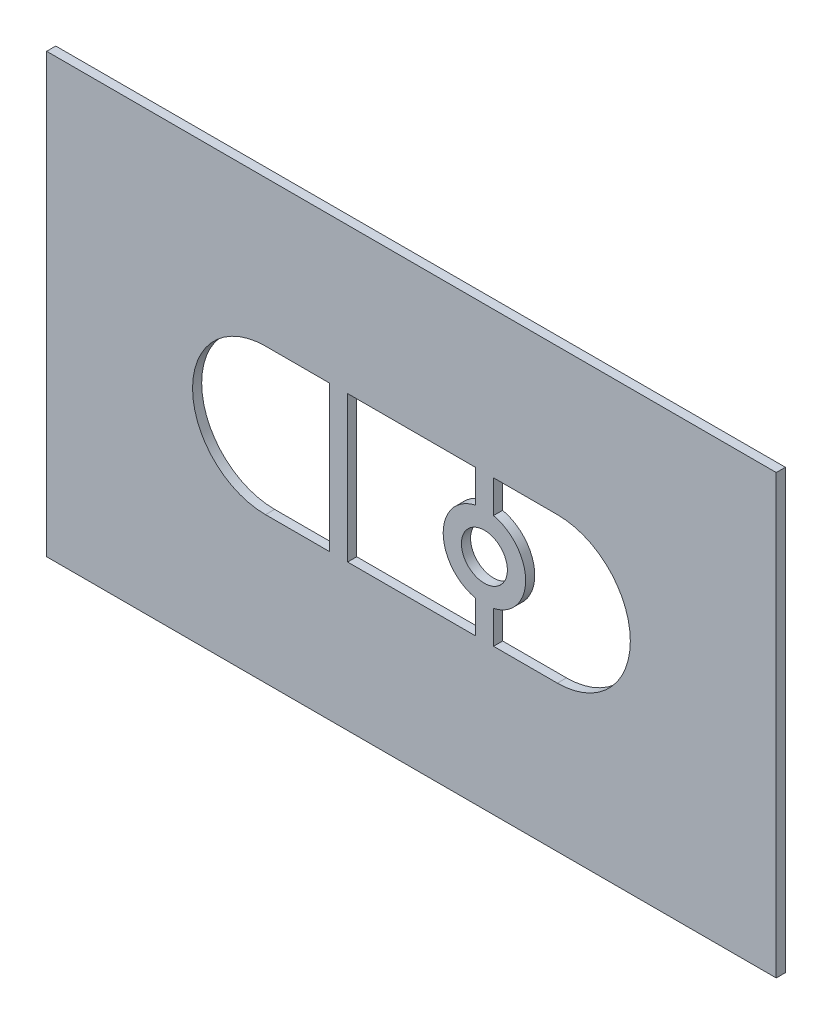
ISO-10303-21;
HEADER;
FILE_DESCRIPTION(('STEP AP214'),'2;1');
FILE_NAME('part.step','',(''),(''),'','','');
FILE_SCHEMA(('AUTOMOTIVE_DESIGN { 1 0 10303 214 1 1 1 1 }'));
ENDSEC;
DATA;
#1=APPLICATION_CONTEXT('core data for automotive mechanical design processes');
#2=APPLICATION_PROTOCOL_DEFINITION('international standard','automotive_design',2000,#1);
#3=PRODUCT_CONTEXT('',#1,'mechanical');
#4=PRODUCT('Part','Part','',(#3));
#5=PRODUCT_RELATED_PRODUCT_CATEGORY('part','',(#4));
#6=PRODUCT_DEFINITION_FORMATION('','',#4);
#7=PRODUCT_DEFINITION_CONTEXT('part definition',#1,'design');
#8=PRODUCT_DEFINITION('design','',#6,#7);
#9=PRODUCT_DEFINITION_SHAPE('','',#8);
#10=(LENGTH_UNIT() NAMED_UNIT(*) SI_UNIT(.MILLI.,.METRE.));
#11=(NAMED_UNIT(*) PLANE_ANGLE_UNIT() SI_UNIT($,.RADIAN.));
#12=(NAMED_UNIT(*) SI_UNIT($,.STERADIAN.) SOLID_ANGLE_UNIT());
#13=UNCERTAINTY_MEASURE_WITH_UNIT(LENGTH_MEASURE(1.E-05),#10,'distance_accuracy_value','');
#14=(GEOMETRIC_REPRESENTATION_CONTEXT(3) GLOBAL_UNCERTAINTY_ASSIGNED_CONTEXT((#13)) GLOBAL_UNIT_ASSIGNED_CONTEXT((#10,
#11,#12)) REPRESENTATION_CONTEXT('',''));
#15=CARTESIAN_POINT('',(0.,0.,0.));
#16=DIRECTION('',(0.,0.,1.));
#17=DIRECTION('',(1.,0.,0.));
#18=AXIS2_PLACEMENT_3D('',#15,#16,#17);
#19=CARTESIAN_POINT('',(0.,0.,1.5875));
#20=DIRECTION('',(0.,0.,-1.));
#21=DIRECTION('',(-1.,0.,0.));
#22=AXIS2_PLACEMENT_3D('',#19,#20,#21);
#23=PLANE('',#22);
#24=CARTESIAN_POINT('',(88.9,38.1,1.5875));
#25=DIRECTION('',(0.,0.,1.));
#26=DIRECTION('',(1.,0.,0.));
#27=AXIS2_PLACEMENT_3D('',#24,#25,#26);
#28=CIRCLE('',#27,12.7);
#29=CARTESIAN_POINT('',(88.9,25.4,1.5875));
#30=VERTEX_POINT('',#29);
#31=CARTESIAN_POINT('',(88.9,50.8,1.5875));
#32=VERTEX_POINT('',#31);
#33=EDGE_CURVE('E249',#30,#32,#28,.T.);
#34=ORIENTED_EDGE('',*,*,#33,.F.);
#35=DIRECTION('',(1.,0.,0.));
#36=VECTOR('',#35,1.);
#37=CARTESIAN_POINT('',(88.9,25.4,1.5875));
#38=LINE('',#37,#36);
#39=CARTESIAN_POINT('',(77.7875,25.4,1.5875));
#40=VERTEX_POINT('',#39);
#41=EDGE_CURVE('E266',#40,#30,#38,.T.);
#42=ORIENTED_EDGE('',*,*,#41,.F.);
#43=DIRECTION('',(0.,-1.,0.));
#44=VECTOR('',#43,1.);
#45=CARTESIAN_POINT('',(77.7875,31.1028242304484,1.5875));
#46=LINE('',#45,#44);
#47=CARTESIAN_POINT('',(77.7875,31.1028242304484,1.5875));
#48=VERTEX_POINT('',#47);
#49=EDGE_CURVE('E262',#48,#40,#46,.T.);
#50=ORIENTED_EDGE('',*,*,#49,.F.);
#51=CARTESIAN_POINT('',(76.2,38.1,1.5875));
#52=DIRECTION('',(0.,0.,-1.));
#53=DIRECTION('',(1.,0.,0.));
#54=AXIS2_PLACEMENT_3D('',#51,#52,#53);
#55=CIRCLE('',#54,7.17499999999999);
#56=CARTESIAN_POINT('',(77.7875,45.0971757695516,1.5875));
#57=VERTEX_POINT('',#56);
#58=EDGE_CURVE('E259',#57,#48,#55,.T.);
#59=ORIENTED_EDGE('',*,*,#58,.F.);
#60=DIRECTION('',(0.,-1.,0.));
#61=VECTOR('',#60,1.);
#62=CARTESIAN_POINT('',(77.7875,50.8,1.5875));
#63=LINE('',#62,#61);
#64=CARTESIAN_POINT('',(77.7875,50.8,1.5875));
#65=VERTEX_POINT('',#64);
#66=EDGE_CURVE('E256',#65,#57,#63,.T.);
#67=ORIENTED_EDGE('',*,*,#66,.F.);
#68=DIRECTION('',(-1.,0.,0.));
#69=VECTOR('',#68,1.);
#70=CARTESIAN_POINT('',(77.7875,50.8,1.5875));
#71=LINE('',#70,#69);
#72=EDGE_CURVE('E252',#32,#65,#71,.T.);
#73=ORIENTED_EDGE('',*,*,#72,.F.);
#74=EDGE_LOOP('',(#34,#42,#50,#59,#67,#73));
#75=FACE_BOUND('',#74,.T.);
#76=DIRECTION('',(0.,-1.,0.));
#77=VECTOR('',#76,1.);
#78=CARTESIAN_POINT('',(0.,0.,1.5875));
#79=LINE('',#78,#77);
#80=CARTESIAN_POINT('',(0.,76.2,1.5875));
#81=VERTEX_POINT('',#80);
#82=CARTESIAN_POINT('',(0.,0.,1.5875));
#83=VERTEX_POINT('',#82);
#84=EDGE_CURVE('E355',#81,#83,#79,.T.);
#85=ORIENTED_EDGE('',*,*,#84,.T.);
#86=DIRECTION('',(1.,0.,0.));
#87=VECTOR('',#86,1.);
#88=CARTESIAN_POINT('',(0.,0.,1.5875));
#89=LINE('',#88,#87);
#90=CARTESIAN_POINT('',(127.,0.,1.5875));
#91=VERTEX_POINT('',#90);
#92=EDGE_CURVE('E359',#83,#91,#89,.T.);
#93=ORIENTED_EDGE('',*,*,#92,.T.);
#94=DIRECTION('',(0.,1.,0.));
#95=VECTOR('',#94,1.);
#96=CARTESIAN_POINT('',(127.,0.,1.5875));
#97=LINE('',#96,#95);
#98=CARTESIAN_POINT('',(127.,76.2,1.5875));
#99=VERTEX_POINT('',#98);
#100=EDGE_CURVE('E363',#91,#99,#97,.T.);
#101=ORIENTED_EDGE('',*,*,#100,.T.);
#102=DIRECTION('',(-1.,0.,0.));
#103=VECTOR('',#102,1.);
#104=CARTESIAN_POINT('',(0.,76.2,1.5875));
#105=LINE('',#104,#103);
#106=EDGE_CURVE('E366',#99,#81,#105,.T.);
#107=ORIENTED_EDGE('',*,*,#106,.T.);
#108=EDGE_LOOP('',(#85,#93,#101,#107));
#109=FACE_BOUND('',#108,.T.);
#110=DIRECTION('',(0.,1.,0.));
#111=VECTOR('',#110,1.);
#112=CARTESIAN_POINT('',(49.2125,50.8,1.5875));
#113=LINE('',#112,#111);
#114=CARTESIAN_POINT('',(49.2125,25.4,1.5875));
#115=VERTEX_POINT('',#114);
#116=CARTESIAN_POINT('',(49.2125,50.8,1.5875));
#117=VERTEX_POINT('',#116);
#118=EDGE_CURVE('E312',#115,#117,#113,.T.);
#119=ORIENTED_EDGE('',*,*,#118,.F.);
#120=DIRECTION('',(1.,0.,0.));
#121=VECTOR('',#120,1.);
#122=CARTESIAN_POINT('',(49.2125,25.4,1.5875));
#123=LINE('',#122,#121);
#124=CARTESIAN_POINT('',(38.1,25.4,1.5875));
#125=VERTEX_POINT('',#124);
#126=EDGE_CURVE('E323',#125,#115,#123,.T.);
#127=ORIENTED_EDGE('',*,*,#126,.F.);
#128=CARTESIAN_POINT('',(38.1,38.1,1.5875));
#129=DIRECTION('',(0.,0.,1.));
#130=DIRECTION('',(1.,0.,0.));
#131=AXIS2_PLACEMENT_3D('',#128,#129,#130);
#132=CIRCLE('',#131,12.7);
#133=CARTESIAN_POINT('',(38.1,50.8,1.5875));
#134=VERTEX_POINT('',#133);
#135=EDGE_CURVE('E319',#134,#125,#132,.T.);
#136=ORIENTED_EDGE('',*,*,#135,.F.);
#137=DIRECTION('',(-1.,0.,0.));
#138=VECTOR('',#137,1.);
#139=CARTESIAN_POINT('',(38.1,50.8,1.5875));
#140=LINE('',#139,#138);
#141=EDGE_CURVE('E315',#117,#134,#140,.T.);
#142=ORIENTED_EDGE('',*,*,#141,.F.);
#143=EDGE_LOOP('',(#119,#127,#136,#142));
#144=FACE_BOUND('',#143,.T.);
#145=DIRECTION('',(0.,1.,0.));
#146=VECTOR('',#145,1.);
#147=CARTESIAN_POINT('',(74.6125,50.8,1.5875));
#148=LINE('',#147,#146);
#149=CARTESIAN_POINT('',(74.6125,45.0971757695516,1.5875));
#150=VERTEX_POINT('',#149);
#151=CARTESIAN_POINT('',(74.6125,50.8,1.5875));
#152=VERTEX_POINT('',#151);
#153=EDGE_CURVE('E177',#150,#152,#148,.T.);
#154=ORIENTED_EDGE('',*,*,#153,.F.);
#155=CARTESIAN_POINT('',(76.2,38.1,1.5875));
#156=DIRECTION('',(0.,0.,-1.));
#157=DIRECTION('',(1.,0.,0.));
#158=AXIS2_PLACEMENT_3D('',#155,#156,#157);
#159=CIRCLE('',#158,7.175);
#160=CARTESIAN_POINT('',(74.6125,31.1028242304484,1.5875));
#161=VERTEX_POINT('',#160);
#162=EDGE_CURVE('E214',#161,#150,#159,.T.);
#163=ORIENTED_EDGE('',*,*,#162,.F.);
#164=DIRECTION('',(0.,1.,0.));
#165=VECTOR('',#164,1.);
#166=CARTESIAN_POINT('',(74.6125,31.1028242304484,1.5875));
#167=LINE('',#166,#165);
#168=CARTESIAN_POINT('',(74.6125,25.4,1.5875));
#169=VERTEX_POINT('',#168);
#170=EDGE_CURVE('E211',#169,#161,#167,.T.);
#171=ORIENTED_EDGE('',*,*,#170,.F.);
#172=DIRECTION('',(1.,0.,0.));
#173=VECTOR('',#172,1.);
#174=CARTESIAN_POINT('',(74.6125,25.4,1.5875));
#175=LINE('',#174,#173);
#176=CARTESIAN_POINT('',(52.3875,25.4,1.5875));
#177=VERTEX_POINT('',#176);
#178=EDGE_CURVE('E205',#177,#169,#175,.T.);
#179=ORIENTED_EDGE('',*,*,#178,.F.);
#180=DIRECTION('',(0.,-1.,0.));
#181=VECTOR('',#180,1.);
#182=CARTESIAN_POINT('',(52.3875,25.4,1.5875));
#183=LINE('',#182,#181);
#184=CARTESIAN_POINT('',(52.3875,50.8,1.5875));
#185=VERTEX_POINT('',#184);
#186=EDGE_CURVE('E201',#185,#177,#183,.T.);
#187=ORIENTED_EDGE('',*,*,#186,.F.);
#188=DIRECTION('',(-1.,0.,0.));
#189=VECTOR('',#188,1.);
#190=CARTESIAN_POINT('',(52.3875,50.8,1.5875));
#191=LINE('',#190,#189);
#192=EDGE_CURVE('E186',#152,#185,#191,.T.);
#193=ORIENTED_EDGE('',*,*,#192,.F.);
#194=EDGE_LOOP('',(#154,#163,#171,#179,#187,#193));
#195=FACE_BOUND('',#194,.T.);
#196=CARTESIAN_POINT('',(76.2,38.1,1.5875));
#197=DIRECTION('',(0.,0.,1.));
#198=DIRECTION('',(1.,0.,0.));
#199=AXIS2_PLACEMENT_3D('',#196,#197,#198);
#200=CIRCLE('',#199,3.99999999999999);
#201=CARTESIAN_POINT('',(80.2,38.1,1.5875));
#202=VERTEX_POINT('',#201);
#203=EDGE_CURVE('E219',#202,#202,#200,.T.);
#204=ORIENTED_EDGE('',*,*,#203,.F.);
#205=EDGE_LOOP('',(#204));
#206=FACE_BOUND('',#205,.T.);
#207=ADVANCED_FACE('F39',(#75,#109,#144,#195,#206),#23,.F.);
#208=CARTESIAN_POINT('',(0.,0.,0.));
#209=DIRECTION('',(0.,0.,-1.));
#210=DIRECTION('',(-1.,0.,0.));
#211=AXIS2_PLACEMENT_3D('',#208,#209,#210);
#212=PLANE('',#211);
#213=CARTESIAN_POINT('',(76.2,38.1,0.));
#214=DIRECTION('',(0.,0.,-1.));
#215=DIRECTION('',(1.,0.,0.));
#216=AXIS2_PLACEMENT_3D('',#213,#214,#215);
#217=CIRCLE('',#216,7.175);
#218=CARTESIAN_POINT('',(74.6125,31.1028242304484,0.));
#219=VERTEX_POINT('',#218);
#220=CARTESIAN_POINT('',(74.6125,45.0971757695516,0.));
#221=VERTEX_POINT('',#220);
#222=EDGE_CURVE('E187',#219,#221,#217,.T.);
#223=ORIENTED_EDGE('',*,*,#222,.T.);
#224=DIRECTION('',(0.,1.,0.));
#225=VECTOR('',#224,1.);
#226=CARTESIAN_POINT('',(74.6125,50.8,0.));
#227=LINE('',#226,#225);
#228=CARTESIAN_POINT('',(74.6125,50.8,0.));
#229=VERTEX_POINT('',#228);
#230=EDGE_CURVE('E63',#221,#229,#227,.T.);
#231=ORIENTED_EDGE('',*,*,#230,.T.);
#232=DIRECTION('',(-1.,0.,0.));
#233=VECTOR('',#232,1.);
#234=CARTESIAN_POINT('',(52.3875,50.8,0.));
#235=LINE('',#234,#233);
#236=CARTESIAN_POINT('',(52.3875,50.8,0.));
#237=VERTEX_POINT('',#236);
#238=EDGE_CURVE('E193',#229,#237,#235,.T.);
#239=ORIENTED_EDGE('',*,*,#238,.T.);
#240=DIRECTION('',(0.,-1.,0.));
#241=VECTOR('',#240,1.);
#242=CARTESIAN_POINT('',(52.3875,25.4,0.));
#243=LINE('',#242,#241);
#244=CARTESIAN_POINT('',(52.3875,25.4,0.));
#245=VERTEX_POINT('',#244);
#246=EDGE_CURVE('E222',#237,#245,#243,.T.);
#247=ORIENTED_EDGE('',*,*,#246,.T.);
#248=DIRECTION('',(1.,0.,0.));
#249=VECTOR('',#248,1.);
#250=CARTESIAN_POINT('',(74.6125,25.4,0.));
#251=LINE('',#250,#249);
#252=CARTESIAN_POINT('',(74.6125,25.4,0.));
#253=VERTEX_POINT('',#252);
#254=EDGE_CURVE('E226',#245,#253,#251,.T.);
#255=ORIENTED_EDGE('',*,*,#254,.T.);
#256=DIRECTION('',(0.,1.,0.));
#257=VECTOR('',#256,1.);
#258=CARTESIAN_POINT('',(74.6125,31.1028242304484,0.));
#259=LINE('',#258,#257);
#260=EDGE_CURVE('E230',#253,#219,#259,.T.);
#261=ORIENTED_EDGE('',*,*,#260,.T.);
#262=EDGE_LOOP('',(#223,#231,#239,#247,#255,#261));
#263=FACE_BOUND('',#262,.T.);
#264=DIRECTION('',(1.,0.,0.));
#265=VECTOR('',#264,1.);
#266=CARTESIAN_POINT('',(88.9,25.4,0.));
#267=LINE('',#266,#265);
#268=CARTESIAN_POINT('',(77.7875,25.4,0.));
#269=VERTEX_POINT('',#268);
#270=CARTESIAN_POINT('',(88.9,25.4,0.));
#271=VERTEX_POINT('',#270);
#272=EDGE_CURVE('E253',#269,#271,#267,.T.);
#273=ORIENTED_EDGE('',*,*,#272,.T.);
#274=CARTESIAN_POINT('',(88.9,38.1,0.));
#275=DIRECTION('',(0.,0.,1.));
#276=DIRECTION('',(1.,0.,0.));
#277=AXIS2_PLACEMENT_3D('',#274,#275,#276);
#278=CIRCLE('',#277,12.7);
#279=CARTESIAN_POINT('',(88.9,50.8,0.));
#280=VERTEX_POINT('',#279);
#281=EDGE_CURVE('E195',#271,#280,#278,.T.);
#282=ORIENTED_EDGE('',*,*,#281,.T.);
#283=DIRECTION('',(-1.,0.,0.));
#284=VECTOR('',#283,1.);
#285=CARTESIAN_POINT('',(77.7875,50.8,0.));
#286=LINE('',#285,#284);
#287=CARTESIAN_POINT('',(77.7875,50.8,0.));
#288=VERTEX_POINT('',#287);
#289=EDGE_CURVE('E273',#280,#288,#286,.T.);
#290=ORIENTED_EDGE('',*,*,#289,.T.);
#291=DIRECTION('',(0.,-1.,0.));
#292=VECTOR('',#291,1.);
#293=CARTESIAN_POINT('',(77.7875,50.8,0.));
#294=LINE('',#293,#292);
#295=CARTESIAN_POINT('',(77.7875,45.0971757695516,0.));
#296=VERTEX_POINT('',#295);
#297=EDGE_CURVE('E277',#288,#296,#294,.T.);
#298=ORIENTED_EDGE('',*,*,#297,.T.);
#299=CARTESIAN_POINT('',(76.2,38.1,0.));
#300=DIRECTION('',(0.,0.,-1.));
#301=DIRECTION('',(1.,0.,0.));
#302=AXIS2_PLACEMENT_3D('',#299,#300,#301);
#303=CIRCLE('',#302,7.17499999999999);
#304=CARTESIAN_POINT('',(77.7875,31.1028242304484,0.));
#305=VERTEX_POINT('',#304);
#306=EDGE_CURVE('E281',#296,#305,#303,.T.);
#307=ORIENTED_EDGE('',*,*,#306,.T.);
#308=DIRECTION('',(0.,-1.,0.));
#309=VECTOR('',#308,1.);
#310=CARTESIAN_POINT('',(77.7875,31.1028242304484,0.));
#311=LINE('',#310,#309);
#312=EDGE_CURVE('E285',#305,#269,#311,.T.);
#313=ORIENTED_EDGE('',*,*,#312,.T.);
#314=EDGE_LOOP('',(#273,#282,#290,#298,#307,#313));
#315=FACE_BOUND('',#314,.T.);
#316=DIRECTION('',(1.,0.,0.));
#317=VECTOR('',#316,1.);
#318=CARTESIAN_POINT('',(49.2125,25.4,0.));
#319=LINE('',#318,#317);
#320=CARTESIAN_POINT('',(38.1,25.4,0.));
#321=VERTEX_POINT('',#320);
#322=CARTESIAN_POINT('',(49.2125,25.4,0.));
#323=VERTEX_POINT('',#322);
#324=EDGE_CURVE('E316',#321,#323,#319,.T.);
#325=ORIENTED_EDGE('',*,*,#324,.T.);
#326=DIRECTION('',(0.,1.,0.));
#327=VECTOR('',#326,1.);
#328=CARTESIAN_POINT('',(49.2125,50.8,0.));
#329=LINE('',#328,#327);
#330=CARTESIAN_POINT('',(49.2125,50.8,0.));
#331=VERTEX_POINT('',#330);
#332=EDGE_CURVE('E311',#323,#331,#329,.T.);
#333=ORIENTED_EDGE('',*,*,#332,.T.);
#334=DIRECTION('',(-1.,0.,0.));
#335=VECTOR('',#334,1.);
#336=CARTESIAN_POINT('',(38.1,50.8,0.));
#337=LINE('',#336,#335);
#338=CARTESIAN_POINT('',(38.1,50.8,0.));
#339=VERTEX_POINT('',#338);
#340=EDGE_CURVE('E330',#331,#339,#337,.T.);
#341=ORIENTED_EDGE('',*,*,#340,.T.);
#342=CARTESIAN_POINT('',(38.1,38.1,0.));
#343=DIRECTION('',(0.,0.,1.));
#344=DIRECTION('',(1.,0.,0.));
#345=AXIS2_PLACEMENT_3D('',#342,#343,#344);
#346=CIRCLE('',#345,12.7);
#347=EDGE_CURVE('E334',#339,#321,#346,.T.);
#348=ORIENTED_EDGE('',*,*,#347,.T.);
#349=EDGE_LOOP('',(#325,#333,#341,#348));
#350=FACE_BOUND('',#349,.T.);
#351=DIRECTION('',(0.,-1.,0.));
#352=VECTOR('',#351,1.);
#353=CARTESIAN_POINT('',(0.,0.,0.));
#354=LINE('',#353,#352);
#355=CARTESIAN_POINT('',(0.,76.2,0.));
#356=VERTEX_POINT('',#355);
#357=CARTESIAN_POINT('',(0.,0.,0.));
#358=VERTEX_POINT('',#357);
#359=EDGE_CURVE('E354',#356,#358,#354,.T.);
#360=ORIENTED_EDGE('',*,*,#359,.F.);
#361=DIRECTION('',(-1.,0.,0.));
#362=VECTOR('',#361,1.);
#363=CARTESIAN_POINT('',(0.,76.2,0.));
#364=LINE('',#363,#362);
#365=CARTESIAN_POINT('',(127.,76.2,0.));
#366=VERTEX_POINT('',#365);
#367=EDGE_CURVE('E360',#366,#356,#364,.T.);
#368=ORIENTED_EDGE('',*,*,#367,.F.);
#369=DIRECTION('',(0.,1.,0.));
#370=VECTOR('',#369,1.);
#371=CARTESIAN_POINT('',(127.,0.,0.));
#372=LINE('',#371,#370);
#373=CARTESIAN_POINT('',(127.,0.,0.));
#374=VERTEX_POINT('',#373);
#375=EDGE_CURVE('E376',#374,#366,#372,.T.);
#376=ORIENTED_EDGE('',*,*,#375,.F.);
#377=DIRECTION('',(1.,0.,0.));
#378=VECTOR('',#377,1.);
#379=CARTESIAN_POINT('',(0.,0.,0.));
#380=LINE('',#379,#378);
#381=EDGE_CURVE('E373',#358,#374,#380,.T.);
#382=ORIENTED_EDGE('',*,*,#381,.F.);
#383=EDGE_LOOP('',(#360,#368,#376,#382));
#384=FACE_BOUND('',#383,.T.);
#385=CARTESIAN_POINT('',(76.2,38.1,0.));
#386=DIRECTION('',(0.,0.,1.));
#387=DIRECTION('',(1.,0.,0.));
#388=AXIS2_PLACEMENT_3D('',#385,#386,#387);
#389=CIRCLE('',#388,3.99999999999999);
#390=CARTESIAN_POINT('',(80.2,38.1,0.));
#391=VERTEX_POINT('',#390);
#392=EDGE_CURVE('E514',#391,#391,#389,.T.);
#393=ORIENTED_EDGE('',*,*,#392,.T.);
#394=EDGE_LOOP('',(#393));
#395=FACE_BOUND('',#394,.T.);
#396=ADVANCED_FACE('F399',(#263,#315,#350,#384,#395),#212,.T.);
#397=CARTESIAN_POINT('',(0.,0.,1.5875));
#398=DIRECTION('',(1.,0.,0.));
#399=DIRECTION('',(0.,0.,-1.));
#400=AXIS2_PLACEMENT_3D('',#397,#398,#399);
#401=PLANE('',#400);
#402=ORIENTED_EDGE('',*,*,#359,.T.);
#403=DIRECTION('',(0.,0.,-1.));
#404=VECTOR('',#403,1.);
#405=CARTESIAN_POINT('',(0.,0.,1.5875));
#406=LINE('',#405,#404);
#407=EDGE_CURVE('E11',#83,#358,#406,.T.);
#408=ORIENTED_EDGE('',*,*,#407,.F.);
#409=ORIENTED_EDGE('',*,*,#84,.F.);
#410=DIRECTION('',(0.,0.,-1.));
#411=VECTOR('',#410,1.);
#412=CARTESIAN_POINT('',(0.,76.2,1.5875));
#413=LINE('',#412,#411);
#414=EDGE_CURVE('E369',#81,#356,#413,.T.);
#415=ORIENTED_EDGE('',*,*,#414,.T.);
#416=EDGE_LOOP('',(#402,#408,#409,#415));
#417=FACE_BOUND('',#416,.T.);
#418=ADVANCED_FACE('F41',(#417),#401,.F.);
#419=CARTESIAN_POINT('',(0.,0.,1.5875));
#420=DIRECTION('',(0.,1.,0.));
#421=DIRECTION('',(0.,0.,1.));
#422=AXIS2_PLACEMENT_3D('',#419,#420,#421);
#423=PLANE('',#422);
#424=ORIENTED_EDGE('',*,*,#381,.T.);
#425=DIRECTION('',(0.,0.,-1.));
#426=VECTOR('',#425,1.);
#427=CARTESIAN_POINT('',(127.,0.,1.5875));
#428=LINE('',#427,#426);
#429=EDGE_CURVE('E48',#91,#374,#428,.T.);
#430=ORIENTED_EDGE('',*,*,#429,.F.);
#431=ORIENTED_EDGE('',*,*,#92,.F.);
#432=ORIENTED_EDGE('',*,*,#407,.T.);
#433=EDGE_LOOP('',(#424,#430,#431,#432));
#434=FACE_BOUND('',#433,.T.);
#435=ADVANCED_FACE('F410',(#434),#423,.F.);
#436=CARTESIAN_POINT('',(127.,0.,1.5875));
#437=DIRECTION('',(-1.,0.,0.));
#438=DIRECTION('',(0.,0.,1.));
#439=AXIS2_PLACEMENT_3D('',#436,#437,#438);
#440=PLANE('',#439);
#441=ORIENTED_EDGE('',*,*,#375,.T.);
#442=DIRECTION('',(0.,0.,-1.));
#443=VECTOR('',#442,1.);
#444=CARTESIAN_POINT('',(127.,76.2,1.5875));
#445=LINE('',#444,#443);
#446=EDGE_CURVE('E384',#99,#366,#445,.T.);
#447=ORIENTED_EDGE('',*,*,#446,.F.);
#448=ORIENTED_EDGE('',*,*,#100,.F.);
#449=ORIENTED_EDGE('',*,*,#429,.T.);
#450=EDGE_LOOP('',(#441,#447,#448,#449));
#451=FACE_BOUND('',#450,.T.);
#452=ADVANCED_FACE('F393',(#451),#440,.F.);
#453=CARTESIAN_POINT('',(0.,76.2,1.5875));
#454=DIRECTION('',(0.,-1.,0.));
#455=DIRECTION('',(0.,0.,-1.));
#456=AXIS2_PLACEMENT_3D('',#453,#454,#455);
#457=PLANE('',#456);
#458=ORIENTED_EDGE('',*,*,#367,.T.);
#459=ORIENTED_EDGE('',*,*,#414,.F.);
#460=ORIENTED_EDGE('',*,*,#106,.F.);
#461=ORIENTED_EDGE('',*,*,#446,.T.);
#462=EDGE_LOOP('',(#458,#459,#460,#461));
#463=FACE_BOUND('',#462,.T.);
#464=ADVANCED_FACE('F403',(#463),#457,.F.);
#465=CARTESIAN_POINT('',(49.2125,50.8,1.5875));
#466=DIRECTION('',(-1.,0.,0.));
#467=DIRECTION('',(0.,0.,1.));
#468=AXIS2_PLACEMENT_3D('',#465,#466,#467);
#469=PLANE('',#468);
#470=ORIENTED_EDGE('',*,*,#332,.F.);
#471=DIRECTION('',(0.,0.,-1.));
#472=VECTOR('',#471,1.);
#473=CARTESIAN_POINT('',(49.2125,25.4,1.5875));
#474=LINE('',#473,#472);
#475=EDGE_CURVE('E326',#115,#323,#474,.T.);
#476=ORIENTED_EDGE('',*,*,#475,.F.);
#477=ORIENTED_EDGE('',*,*,#118,.T.);
#478=DIRECTION('',(0.,0.,-1.));
#479=VECTOR('',#478,1.);
#480=CARTESIAN_POINT('',(49.2125,50.8,1.5875));
#481=LINE('',#480,#479);
#482=EDGE_CURVE('E350',#117,#331,#481,.T.);
#483=ORIENTED_EDGE('',*,*,#482,.T.);
#484=EDGE_LOOP('',(#470,#476,#477,#483));
#485=FACE_BOUND('',#484,.T.);
#486=ADVANCED_FACE('F427',(#485),#469,.T.);
#487=CARTESIAN_POINT('',(38.1,50.8,1.5875));
#488=DIRECTION('',(0.,-1.,0.));
#489=DIRECTION('',(0.,0.,-1.));
#490=AXIS2_PLACEMENT_3D('',#487,#488,#489);
#491=PLANE('',#490);
#492=ORIENTED_EDGE('',*,*,#340,.F.);
#493=ORIENTED_EDGE('',*,*,#482,.F.);
#494=ORIENTED_EDGE('',*,*,#141,.T.);
#495=DIRECTION('',(0.,0.,-1.));
#496=VECTOR('',#495,1.);
#497=CARTESIAN_POINT('',(38.1,50.8,1.5875));
#498=LINE('',#497,#496);
#499=EDGE_CURVE('E347',#134,#339,#498,.T.);
#500=ORIENTED_EDGE('',*,*,#499,.T.);
#501=EDGE_LOOP('',(#492,#493,#494,#500));
#502=FACE_BOUND('',#501,.T.);
#503=ADVANCED_FACE('F434',(#502),#491,.T.);
#504=CARTESIAN_POINT('',(38.1,38.1,1.5875));
#505=DIRECTION('',(0.,0.,-1.));
#506=DIRECTION('',(-1.,0.,0.));
#507=AXIS2_PLACEMENT_3D('',#504,#505,#506);
#508=CYLINDRICAL_SURFACE('',#507,12.7);
#509=ORIENTED_EDGE('',*,*,#347,.F.);
#510=ORIENTED_EDGE('',*,*,#499,.F.);
#511=ORIENTED_EDGE('',*,*,#135,.T.);
#512=DIRECTION('',(0.,0.,-1.));
#513=VECTOR('',#512,1.);
#514=CARTESIAN_POINT('',(38.1,25.4,1.5875));
#515=LINE('',#514,#513);
#516=EDGE_CURVE('E344',#125,#321,#515,.T.);
#517=ORIENTED_EDGE('',*,*,#516,.T.);
#518=EDGE_LOOP('',(#509,#510,#511,#517));
#519=FACE_BOUND('',#518,.T.);
#520=ADVANCED_FACE('F439',(#519),#508,.F.);
#521=CARTESIAN_POINT('',(49.2125,25.4,1.5875));
#522=DIRECTION('',(0.,1.,0.));
#523=DIRECTION('',(0.,0.,1.));
#524=AXIS2_PLACEMENT_3D('',#521,#522,#523);
#525=PLANE('',#524);
#526=ORIENTED_EDGE('',*,*,#324,.F.);
#527=ORIENTED_EDGE('',*,*,#516,.F.);
#528=ORIENTED_EDGE('',*,*,#126,.T.);
#529=ORIENTED_EDGE('',*,*,#475,.T.);
#530=EDGE_LOOP('',(#526,#527,#528,#529));
#531=FACE_BOUND('',#530,.T.);
#532=ADVANCED_FACE('F447',(#531),#525,.T.);
#533=CARTESIAN_POINT('',(88.9,38.1,1.5875));
#534=DIRECTION('',(0.,0.,-1.));
#535=DIRECTION('',(-1.,0.,0.));
#536=AXIS2_PLACEMENT_3D('',#533,#534,#535);
#537=CYLINDRICAL_SURFACE('',#536,12.7);
#538=ORIENTED_EDGE('',*,*,#281,.F.);
#539=DIRECTION('',(0.,0.,-1.));
#540=VECTOR('',#539,1.);
#541=CARTESIAN_POINT('',(88.9,25.4,1.5875));
#542=LINE('',#541,#540);
#543=EDGE_CURVE('E269',#30,#271,#542,.T.);
#544=ORIENTED_EDGE('',*,*,#543,.F.);
#545=ORIENTED_EDGE('',*,*,#33,.T.);
#546=DIRECTION('',(0.,0.,-1.));
#547=VECTOR('',#546,1.);
#548=CARTESIAN_POINT('',(88.9,50.8,1.5875));
#549=LINE('',#548,#547);
#550=EDGE_CURVE('E307',#32,#280,#549,.T.);
#551=ORIENTED_EDGE('',*,*,#550,.T.);
#552=EDGE_LOOP('',(#538,#544,#545,#551));
#553=FACE_BOUND('',#552,.T.);
#554=ADVANCED_FACE('F459',(#553),#537,.F.);
#555=CARTESIAN_POINT('',(77.7875,50.8,1.5875));
#556=DIRECTION('',(0.,-1.,0.));
#557=DIRECTION('',(1.,0.,0.));
#558=AXIS2_PLACEMENT_3D('',#555,#556,#557);
#559=PLANE('',#558);
#560=ORIENTED_EDGE('',*,*,#289,.F.);
#561=ORIENTED_EDGE('',*,*,#550,.F.);
#562=ORIENTED_EDGE('',*,*,#72,.T.);
#563=DIRECTION('',(0.,0.,-1.));
#564=VECTOR('',#563,1.);
#565=CARTESIAN_POINT('',(77.7875,50.8,1.5875));
#566=LINE('',#565,#564);
#567=EDGE_CURVE('E304',#65,#288,#566,.T.);
#568=ORIENTED_EDGE('',*,*,#567,.T.);
#569=EDGE_LOOP('',(#560,#561,#562,#568));
#570=FACE_BOUND('',#569,.T.);
#571=ADVANCED_FACE('F464',(#570),#559,.T.);
#572=CARTESIAN_POINT('',(77.7875,50.8,1.5875));
#573=DIRECTION('',(1.,0.,0.));
#574=DIRECTION('',(0.,1.,0.));
#575=AXIS2_PLACEMENT_3D('',#572,#573,#574);
#576=PLANE('',#575);
#577=ORIENTED_EDGE('',*,*,#297,.F.);
#578=ORIENTED_EDGE('',*,*,#567,.F.);
#579=ORIENTED_EDGE('',*,*,#66,.T.);
#580=DIRECTION('',(0.,0.,-1.));
#581=VECTOR('',#580,1.);
#582=CARTESIAN_POINT('',(77.7875,45.0971757695516,1.5875));
#583=LINE('',#582,#581);
#584=EDGE_CURVE('E301',#57,#296,#583,.T.);
#585=ORIENTED_EDGE('',*,*,#584,.T.);
#586=EDGE_LOOP('',(#577,#578,#579,#585));
#587=FACE_BOUND('',#586,.T.);
#588=ADVANCED_FACE('F468',(#587),#576,.T.);
#589=CARTESIAN_POINT('',(76.2,38.1,1.5875));
#590=DIRECTION('',(0.,0.,-1.));
#591=DIRECTION('',(-1.,0.,0.));
#592=AXIS2_PLACEMENT_3D('',#589,#590,#591);
#593=CYLINDRICAL_SURFACE('',#592,7.17499999999999);
#594=ORIENTED_EDGE('',*,*,#306,.F.);
#595=ORIENTED_EDGE('',*,*,#584,.F.);
#596=ORIENTED_EDGE('',*,*,#58,.T.);
#597=DIRECTION('',(0.,0.,-1.));
#598=VECTOR('',#597,1.);
#599=CARTESIAN_POINT('',(77.7875,31.1028242304484,1.5875));
#600=LINE('',#599,#598);
#601=EDGE_CURVE('E298',#48,#305,#600,.T.);
#602=ORIENTED_EDGE('',*,*,#601,.T.);
#603=EDGE_LOOP('',(#594,#595,#596,#602));
#604=FACE_BOUND('',#603,.T.);
#605=ADVANCED_FACE('F472',(#604),#593,.T.);
#606=CARTESIAN_POINT('',(77.7875,31.1028242304484,1.5875));
#607=DIRECTION('',(1.,0.,0.));
#608=DIRECTION('',(0.,1.,0.));
#609=AXIS2_PLACEMENT_3D('',#606,#607,#608);
#610=PLANE('',#609);
#611=ORIENTED_EDGE('',*,*,#312,.F.);
#612=ORIENTED_EDGE('',*,*,#601,.F.);
#613=ORIENTED_EDGE('',*,*,#49,.T.);
#614=DIRECTION('',(0.,0.,-1.));
#615=VECTOR('',#614,1.);
#616=CARTESIAN_POINT('',(77.7875,25.4,1.5875));
#617=LINE('',#616,#615);
#618=EDGE_CURVE('E295',#40,#269,#617,.T.);
#619=ORIENTED_EDGE('',*,*,#618,.T.);
#620=EDGE_LOOP('',(#611,#612,#613,#619));
#621=FACE_BOUND('',#620,.T.);
#622=ADVANCED_FACE('F476',(#621),#610,.T.);
#623=CARTESIAN_POINT('',(88.9,25.4,1.5875));
#624=DIRECTION('',(0.,1.,0.));
#625=DIRECTION('',(-1.,0.,0.));
#626=AXIS2_PLACEMENT_3D('',#623,#624,#625);
#627=PLANE('',#626);
#628=ORIENTED_EDGE('',*,*,#272,.F.);
#629=ORIENTED_EDGE('',*,*,#618,.F.);
#630=ORIENTED_EDGE('',*,*,#41,.T.);
#631=ORIENTED_EDGE('',*,*,#543,.T.);
#632=EDGE_LOOP('',(#628,#629,#630,#631));
#633=FACE_BOUND('',#632,.T.);
#634=ADVANCED_FACE('F480',(#633),#627,.T.);
#635=CARTESIAN_POINT('',(74.6125,50.8,1.5875));
#636=DIRECTION('',(-1.,0.,0.));
#637=DIRECTION('',(0.,-1.,0.));
#638=AXIS2_PLACEMENT_3D('',#635,#636,#637);
#639=PLANE('',#638);
#640=ORIENTED_EDGE('',*,*,#230,.F.);
#641=DIRECTION('',(0.,0.,-1.));
#642=VECTOR('',#641,1.);
#643=CARTESIAN_POINT('',(74.6125,45.0971757695516,1.5875));
#644=LINE('',#643,#642);
#645=EDGE_CURVE('E181',#150,#221,#644,.T.);
#646=ORIENTED_EDGE('',*,*,#645,.F.);
#647=ORIENTED_EDGE('',*,*,#153,.T.);
#648=DIRECTION('',(0.,0.,-1.));
#649=VECTOR('',#648,1.);
#650=CARTESIAN_POINT('',(74.6125,50.8,1.5875));
#651=LINE('',#650,#649);
#652=EDGE_CURVE('E180',#152,#229,#651,.T.);
#653=ORIENTED_EDGE('',*,*,#652,.T.);
#654=EDGE_LOOP('',(#640,#646,#647,#653));
#655=FACE_BOUND('',#654,.T.);
#656=ADVANCED_FACE('F179',(#655),#639,.T.);
#657=CARTESIAN_POINT('',(52.3875,50.8,1.5875));
#658=DIRECTION('',(0.,-1.,0.));
#659=DIRECTION('',(1.,0.,0.));
#660=AXIS2_PLACEMENT_3D('',#657,#658,#659);
#661=PLANE('',#660);
#662=ORIENTED_EDGE('',*,*,#238,.F.);
#663=ORIENTED_EDGE('',*,*,#652,.F.);
#664=ORIENTED_EDGE('',*,*,#192,.T.);
#665=DIRECTION('',(0.,0.,-1.));
#666=VECTOR('',#665,1.);
#667=CARTESIAN_POINT('',(52.3875,50.8,1.5875));
#668=LINE('',#667,#666);
#669=EDGE_CURVE('E196',#185,#237,#668,.T.);
#670=ORIENTED_EDGE('',*,*,#669,.T.);
#671=EDGE_LOOP('',(#662,#663,#664,#670));
#672=FACE_BOUND('',#671,.T.);
#673=ADVANCED_FACE('F190',(#672),#661,.T.);
#674=CARTESIAN_POINT('',(52.3875,25.4,1.5875));
#675=DIRECTION('',(1.,0.,0.));
#676=DIRECTION('',(0.,0.,-1.));
#677=AXIS2_PLACEMENT_3D('',#674,#675,#676);
#678=PLANE('',#677);
#679=ORIENTED_EDGE('',*,*,#246,.F.);
#680=ORIENTED_EDGE('',*,*,#669,.F.);
#681=ORIENTED_EDGE('',*,*,#186,.T.);
#682=DIRECTION('',(0.,0.,-1.));
#683=VECTOR('',#682,1.);
#684=CARTESIAN_POINT('',(52.3875,25.4,1.5875));
#685=LINE('',#684,#683);
#686=EDGE_CURVE('E244',#177,#245,#685,.T.);
#687=ORIENTED_EDGE('',*,*,#686,.T.);
#688=EDGE_LOOP('',(#679,#680,#681,#687));
#689=FACE_BOUND('',#688,.T.);
#690=ADVANCED_FACE('F489',(#689),#678,.T.);
#691=CARTESIAN_POINT('',(74.6125,25.4,1.5875));
#692=DIRECTION('',(0.,1.,0.));
#693=DIRECTION('',(-1.,0.,0.));
#694=AXIS2_PLACEMENT_3D('',#691,#692,#693);
#695=PLANE('',#694);
#696=ORIENTED_EDGE('',*,*,#254,.F.);
#697=ORIENTED_EDGE('',*,*,#686,.F.);
#698=ORIENTED_EDGE('',*,*,#178,.T.);
#699=DIRECTION('',(0.,0.,-1.));
#700=VECTOR('',#699,1.);
#701=CARTESIAN_POINT('',(74.6125,25.4,1.5875));
#702=LINE('',#701,#700);
#703=EDGE_CURVE('E241',#169,#253,#702,.T.);
#704=ORIENTED_EDGE('',*,*,#703,.T.);
#705=EDGE_LOOP('',(#696,#697,#698,#704));
#706=FACE_BOUND('',#705,.T.);
#707=ADVANCED_FACE('F492',(#706),#695,.T.);
#708=CARTESIAN_POINT('',(74.6125,31.1028242304484,1.5875));
#709=DIRECTION('',(-1.,0.,0.));
#710=DIRECTION('',(0.,-1.,0.));
#711=AXIS2_PLACEMENT_3D('',#708,#709,#710);
#712=PLANE('',#711);
#713=ORIENTED_EDGE('',*,*,#260,.F.);
#714=ORIENTED_EDGE('',*,*,#703,.F.);
#715=ORIENTED_EDGE('',*,*,#170,.T.);
#716=DIRECTION('',(0.,0.,-1.));
#717=VECTOR('',#716,1.);
#718=CARTESIAN_POINT('',(74.6125,31.1028242304484,1.5875));
#719=LINE('',#718,#717);
#720=EDGE_CURVE('E55',#161,#219,#719,.T.);
#721=ORIENTED_EDGE('',*,*,#720,.T.);
#722=EDGE_LOOP('',(#713,#714,#715,#721));
#723=FACE_BOUND('',#722,.T.);
#724=ADVANCED_FACE('F496',(#723),#712,.T.);
#725=CARTESIAN_POINT('',(76.2,38.1,1.5875));
#726=DIRECTION('',(0.,0.,-1.));
#727=DIRECTION('',(-1.,0.,0.));
#728=AXIS2_PLACEMENT_3D('',#725,#726,#727);
#729=CYLINDRICAL_SURFACE('',#728,7.175);
#730=ORIENTED_EDGE('',*,*,#222,.F.);
#731=ORIENTED_EDGE('',*,*,#720,.F.);
#732=ORIENTED_EDGE('',*,*,#162,.T.);
#733=ORIENTED_EDGE('',*,*,#645,.T.);
#734=EDGE_LOOP('',(#730,#731,#732,#733));
#735=FACE_BOUND('',#734,.T.);
#736=ADVANCED_FACE('F500',(#735),#729,.T.);
#737=CARTESIAN_POINT('',(76.2,38.1,1.5875));
#738=DIRECTION('',(0.,0.,-1.));
#739=DIRECTION('',(-1.,0.,0.));
#740=AXIS2_PLACEMENT_3D('',#737,#738,#739);
#741=CYLINDRICAL_SURFACE('',#740,3.99999999999999);
#742=ORIENTED_EDGE('',*,*,#203,.T.);
#743=EDGE_LOOP('',(#742));
#744=FACE_BOUND('',#743,.T.);
#745=ORIENTED_EDGE('',*,*,#392,.F.);
#746=EDGE_LOOP('',(#745));
#747=FACE_BOUND('',#746,.T.);
#748=ADVANCED_FACE('F504',(#744,#747),#741,.F.);
#749=CLOSED_SHELL('',(#207,#396,#418,#435,#452,#464,#486,#503,#520,#532,#554,#571,#588,#605,
#622,#634,#656,#673,#690,#707,#724,#736,#748));
#750=MANIFOLD_SOLID_BREP('B2',#749);
#751=ADVANCED_BREP_SHAPE_REPRESENTATION('',(#18,#750),#14);
#752=SHAPE_DEFINITION_REPRESENTATION(#9,#751);
ENDSEC;
END-ISO-10303-21;
